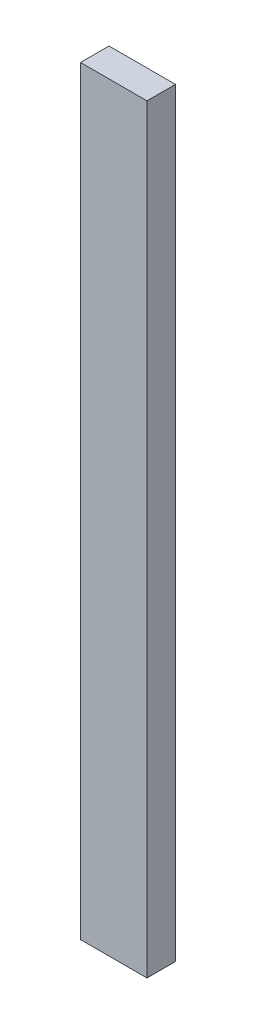
ISO-10303-21;
HEADER;
FILE_DESCRIPTION(('STEP AP214'),'2;1');
FILE_NAME('part.step','',(''),(''),'','','');
FILE_SCHEMA(('AUTOMOTIVE_DESIGN { 1 0 10303 214 1 1 1 1 }'));
ENDSEC;
DATA;
#1=APPLICATION_CONTEXT('core data for automotive mechanical design processes');
#2=APPLICATION_PROTOCOL_DEFINITION('international standard','automotive_design',2000,#1);
#3=PRODUCT_CONTEXT('',#1,'mechanical');
#4=PRODUCT('Part','Part','',(#3));
#5=PRODUCT_RELATED_PRODUCT_CATEGORY('part','',(#4));
#6=PRODUCT_DEFINITION_FORMATION('','',#4);
#7=PRODUCT_DEFINITION_CONTEXT('part definition',#1,'design');
#8=PRODUCT_DEFINITION('design','',#6,#7);
#9=PRODUCT_DEFINITION_SHAPE('','',#8);
#10=(LENGTH_UNIT() NAMED_UNIT(*) SI_UNIT(.MILLI.,.METRE.));
#11=(NAMED_UNIT(*) PLANE_ANGLE_UNIT() SI_UNIT($,.RADIAN.));
#12=(NAMED_UNIT(*) SI_UNIT($,.STERADIAN.) SOLID_ANGLE_UNIT());
#13=UNCERTAINTY_MEASURE_WITH_UNIT(LENGTH_MEASURE(1.E-05),#10,'distance_accuracy_value','');
#14=(GEOMETRIC_REPRESENTATION_CONTEXT(3) GLOBAL_UNCERTAINTY_ASSIGNED_CONTEXT((#13)) GLOBAL_UNIT_ASSIGNED_CONTEXT((#10,
#11,#12)) REPRESENTATION_CONTEXT('',''));
#15=CARTESIAN_POINT('',(0.,0.,0.));
#16=DIRECTION('',(0.,0.,1.));
#17=DIRECTION('',(1.,0.,0.));
#18=AXIS2_PLACEMENT_3D('',#15,#16,#17);
#19=CARTESIAN_POINT('',(16.8884935487463,80.,0.));
#20=DIRECTION('',(-1.,0.,0.));
#21=DIRECTION('',(0.,0.,1.));
#22=AXIS2_PLACEMENT_3D('',#19,#20,#21);
#23=PLANE('',#22);
#24=DIRECTION('',(0.,0.,-1.));
#25=VECTOR('',#24,1.);
#26=CARTESIAN_POINT('',(16.8884935487463,0.,0.));
#27=LINE('',#26,#25);
#28=CARTESIAN_POINT('',(16.8884935487463,0.,7.69853817650301));
#29=VERTEX_POINT('',#28);
#30=CARTESIAN_POINT('',(16.8884935487463,0.,4.69853817650301));
#31=VERTEX_POINT('',#30);
#32=EDGE_CURVE('E98',#29,#31,#27,.T.);
#33=ORIENTED_EDGE('',*,*,#32,.F.);
#34=DIRECTION('',(0.,-1.,0.));
#35=VECTOR('',#34,1.);
#36=CARTESIAN_POINT('',(16.8884935487463,80.,7.69853817650301));
#37=LINE('',#36,#35);
#38=CARTESIAN_POINT('',(16.8884935487463,80.,7.69853817650301));
#39=VERTEX_POINT('',#38);
#40=EDGE_CURVE('E11',#39,#29,#37,.T.);
#41=ORIENTED_EDGE('',*,*,#40,.F.);
#42=DIRECTION('',(0.,0.,-1.));
#43=VECTOR('',#42,1.);
#44=CARTESIAN_POINT('',(16.8884935487463,80.,0.));
#45=LINE('',#44,#43);
#46=CARTESIAN_POINT('',(16.8884935487463,80.,4.69853817650301));
#47=VERTEX_POINT('',#46);
#48=EDGE_CURVE('E92',#39,#47,#45,.T.);
#49=ORIENTED_EDGE('',*,*,#48,.T.);
#50=DIRECTION('',(0.,-1.,0.));
#51=VECTOR('',#50,1.);
#52=CARTESIAN_POINT('',(16.8884935487463,80.,4.69853817650301));
#53=LINE('',#52,#51);
#54=EDGE_CURVE('E73',#47,#31,#53,.T.);
#55=ORIENTED_EDGE('',*,*,#54,.T.);
#56=EDGE_LOOP('',(#33,#41,#49,#55));
#57=FACE_BOUND('',#56,.T.);
#58=ADVANCED_FACE('F35',(#57),#23,.T.);
#59=CARTESIAN_POINT('',(0.,80.,7.69853817650301));
#60=DIRECTION('',(0.,0.,1.));
#61=DIRECTION('',(1.,0.,0.));
#62=AXIS2_PLACEMENT_3D('',#59,#60,#61);
#63=PLANE('',#62);
#64=DIRECTION('',(-1.,0.,0.));
#65=VECTOR('',#64,1.);
#66=CARTESIAN_POINT('',(0.,0.,7.69853817650301));
#67=LINE('',#66,#65);
#68=CARTESIAN_POINT('',(23.8884935487463,0.,7.69853817650301));
#69=VERTEX_POINT('',#68);
#70=EDGE_CURVE('E86',#69,#29,#67,.T.);
#71=ORIENTED_EDGE('',*,*,#70,.F.);
#72=DIRECTION('',(0.,-1.,0.));
#73=VECTOR('',#72,1.);
#74=CARTESIAN_POINT('',(23.8884935487463,80.,7.69853817650301));
#75=LINE('',#74,#73);
#76=CARTESIAN_POINT('',(23.8884935487463,80.,7.69853817650301));
#77=VERTEX_POINT('',#76);
#78=EDGE_CURVE('E43',#77,#69,#75,.T.);
#79=ORIENTED_EDGE('',*,*,#78,.F.);
#80=DIRECTION('',(-1.,0.,0.));
#81=VECTOR('',#80,1.);
#82=CARTESIAN_POINT('',(0.,80.,7.69853817650301));
#83=LINE('',#82,#81);
#84=EDGE_CURVE('E84',#77,#39,#83,.T.);
#85=ORIENTED_EDGE('',*,*,#84,.T.);
#86=ORIENTED_EDGE('',*,*,#40,.T.);
#87=EDGE_LOOP('',(#71,#79,#85,#86));
#88=FACE_BOUND('',#87,.T.);
#89=ADVANCED_FACE('F82',(#88),#63,.T.);
#90=CARTESIAN_POINT('',(23.8884935487463,80.,0.));
#91=DIRECTION('',(-1.,0.,0.));
#92=DIRECTION('',(0.,0.,1.));
#93=AXIS2_PLACEMENT_3D('',#90,#91,#92);
#94=PLANE('',#93);
#95=DIRECTION('',(0.,0.,-1.));
#96=VECTOR('',#95,1.);
#97=CARTESIAN_POINT('',(23.8884935487463,0.,0.));
#98=LINE('',#97,#96);
#99=CARTESIAN_POINT('',(23.8884935487463,0.,4.69853817650301));
#100=VERTEX_POINT('',#99);
#101=EDGE_CURVE('E66',#69,#100,#98,.T.);
#102=ORIENTED_EDGE('',*,*,#101,.T.);
#103=DIRECTION('',(0.,-1.,0.));
#104=VECTOR('',#103,1.);
#105=CARTESIAN_POINT('',(23.8884935487463,80.,4.69853817650301));
#106=LINE('',#105,#104);
#107=CARTESIAN_POINT('',(23.8884935487463,80.,4.69853817650301));
#108=VERTEX_POINT('',#107);
#109=EDGE_CURVE('E87',#108,#100,#106,.T.);
#110=ORIENTED_EDGE('',*,*,#109,.F.);
#111=DIRECTION('',(0.,0.,-1.));
#112=VECTOR('',#111,1.);
#113=CARTESIAN_POINT('',(23.8884935487463,80.,0.));
#114=LINE('',#113,#112);
#115=EDGE_CURVE('E88',#77,#108,#114,.T.);
#116=ORIENTED_EDGE('',*,*,#115,.F.);
#117=ORIENTED_EDGE('',*,*,#78,.T.);
#118=EDGE_LOOP('',(#102,#110,#116,#117));
#119=FACE_BOUND('',#118,.T.);
#120=ADVANCED_FACE('F89',(#119),#94,.F.);
#121=CARTESIAN_POINT('',(0.,80.,4.69853817650301));
#122=DIRECTION('',(0.,0.,1.));
#123=DIRECTION('',(1.,0.,0.));
#124=AXIS2_PLACEMENT_3D('',#121,#122,#123);
#125=PLANE('',#124);
#126=DIRECTION('',(-1.,0.,0.));
#127=VECTOR('',#126,1.);
#128=CARTESIAN_POINT('',(0.,0.,4.69853817650301));
#129=LINE('',#128,#127);
#130=EDGE_CURVE('E94',#100,#31,#129,.T.);
#131=ORIENTED_EDGE('',*,*,#130,.T.);
#132=ORIENTED_EDGE('',*,*,#54,.F.);
#133=DIRECTION('',(-1.,0.,0.));
#134=VECTOR('',#133,1.);
#135=CARTESIAN_POINT('',(0.,80.,4.69853817650301));
#136=LINE('',#135,#134);
#137=EDGE_CURVE('E51',#108,#47,#136,.T.);
#138=ORIENTED_EDGE('',*,*,#137,.F.);
#139=ORIENTED_EDGE('',*,*,#109,.T.);
#140=EDGE_LOOP('',(#131,#132,#138,#139));
#141=FACE_BOUND('',#140,.T.);
#142=ADVANCED_FACE('F107',(#141),#125,.F.);
#143=CARTESIAN_POINT('',(0.,80.,0.));
#144=DIRECTION('',(0.,1.,0.));
#145=DIRECTION('',(0.,0.,1.));
#146=AXIS2_PLACEMENT_3D('',#143,#144,#145);
#147=PLANE('',#146);
#148=ORIENTED_EDGE('',*,*,#48,.F.);
#149=ORIENTED_EDGE('',*,*,#84,.F.);
#150=ORIENTED_EDGE('',*,*,#115,.T.);
#151=ORIENTED_EDGE('',*,*,#137,.T.);
#152=EDGE_LOOP('',(#148,#149,#150,#151));
#153=FACE_BOUND('',#152,.T.);
#154=ADVANCED_FACE('F91',(#153),#147,.T.);
#155=CARTESIAN_POINT('',(0.,0.,0.));
#156=DIRECTION('',(0.,1.,0.));
#157=DIRECTION('',(0.,0.,1.));
#158=AXIS2_PLACEMENT_3D('',#155,#156,#157);
#159=PLANE('',#158);
#160=ORIENTED_EDGE('',*,*,#32,.T.);
#161=ORIENTED_EDGE('',*,*,#130,.F.);
#162=ORIENTED_EDGE('',*,*,#101,.F.);
#163=ORIENTED_EDGE('',*,*,#70,.T.);
#164=EDGE_LOOP('',(#160,#161,#162,#163));
#165=FACE_BOUND('',#164,.T.);
#166=ADVANCED_FACE('F109',(#165),#159,.F.);
#167=CLOSED_SHELL('',(#58,#89,#120,#142,#154,#166));
#168=MANIFOLD_SOLID_BREP('B2',#167);
#169=ADVANCED_BREP_SHAPE_REPRESENTATION('',(#18,#168),#14);
#170=SHAPE_DEFINITION_REPRESENTATION(#9,#169);
ENDSEC;
END-ISO-10303-21;
